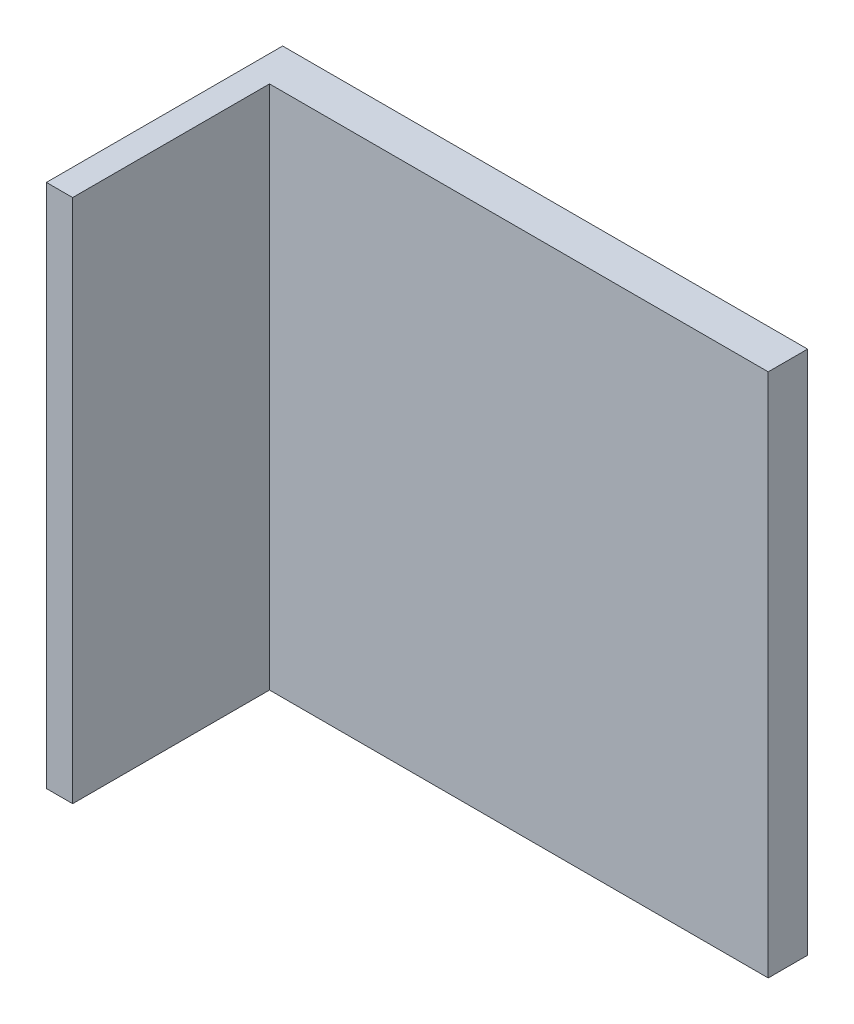
ISO-10303-21;
HEADER;
FILE_DESCRIPTION(('STEP AP214'),'2;1');
FILE_NAME('part.step','',(''),(''),'','','');
FILE_SCHEMA(('AUTOMOTIVE_DESIGN { 1 0 10303 214 1 1 1 1 }'));
ENDSEC;
DATA;
#1=APPLICATION_CONTEXT('core data for automotive mechanical design processes');
#2=APPLICATION_PROTOCOL_DEFINITION('international standard','automotive_design',2000,#1);
#3=PRODUCT_CONTEXT('',#1,'mechanical');
#4=PRODUCT('Part','Part','',(#3));
#5=PRODUCT_RELATED_PRODUCT_CATEGORY('part','',(#4));
#6=PRODUCT_DEFINITION_FORMATION('','',#4);
#7=PRODUCT_DEFINITION_CONTEXT('part definition',#1,'design');
#8=PRODUCT_DEFINITION('design','',#6,#7);
#9=PRODUCT_DEFINITION_SHAPE('','',#8);
#10=(LENGTH_UNIT() NAMED_UNIT(*) SI_UNIT(.MILLI.,.METRE.));
#11=(NAMED_UNIT(*) PLANE_ANGLE_UNIT() SI_UNIT($,.RADIAN.));
#12=(NAMED_UNIT(*) SI_UNIT($,.STERADIAN.) SOLID_ANGLE_UNIT());
#13=UNCERTAINTY_MEASURE_WITH_UNIT(LENGTH_MEASURE(1.E-05),#10,'distance_accuracy_value','');
#14=(GEOMETRIC_REPRESENTATION_CONTEXT(3) GLOBAL_UNCERTAINTY_ASSIGNED_CONTEXT((#13)) GLOBAL_UNIT_ASSIGNED_CONTEXT((#10,
#11,#12)) REPRESENTATION_CONTEXT('',''));
#15=CARTESIAN_POINT('',(0.,0.,0.));
#16=DIRECTION('',(0.,0.,1.));
#17=DIRECTION('',(1.,0.,0.));
#18=AXIS2_PLACEMENT_3D('',#15,#16,#17);
#19=CARTESIAN_POINT('',(-75.,150.,15.));
#20=DIRECTION('',(1.,0.,0.));
#21=DIRECTION('',(0.,1.,0.));
#22=AXIS2_PLACEMENT_3D('',#19,#20,#21);
#23=PLANE('',#22);
#24=DIRECTION('',(0.,-1.,0.));
#25=VECTOR('',#24,1.);
#26=CARTESIAN_POINT('',(-75.,150.,0.));
#27=LINE('',#26,#25);
#28=CARTESIAN_POINT('',(-75.,150.,0.));
#29=VERTEX_POINT('',#28);
#30=CARTESIAN_POINT('',(-75.,-50.,0.));
#31=VERTEX_POINT('',#30);
#32=EDGE_CURVE('E91',#29,#31,#27,.T.);
#33=ORIENTED_EDGE('',*,*,#32,.T.);
#34=DIRECTION('',(0.,0.,-1.));
#35=VECTOR('',#34,1.);
#36=CARTESIAN_POINT('',(-75.,-50.,15.));
#37=LINE('',#36,#35);
#38=CARTESIAN_POINT('',(-75.,-50.,90.));
#39=VERTEX_POINT('',#38);
#40=EDGE_CURVE('E11',#39,#31,#37,.T.);
#41=ORIENTED_EDGE('',*,*,#40,.F.);
#42=DIRECTION('',(0.,-1.,0.));
#43=VECTOR('',#42,1.);
#44=CARTESIAN_POINT('',(-75.,150.,90.));
#45=LINE('',#44,#43);
#46=CARTESIAN_POINT('',(-75.,150.,90.));
#47=VERTEX_POINT('',#46);
#48=EDGE_CURVE('E93',#47,#39,#45,.T.);
#49=ORIENTED_EDGE('',*,*,#48,.F.);
#50=DIRECTION('',(0.,0.,-1.));
#51=VECTOR('',#50,1.);
#52=CARTESIAN_POINT('',(-75.,150.,15.));
#53=LINE('',#52,#51);
#54=EDGE_CURVE('E77',#47,#29,#53,.T.);
#55=ORIENTED_EDGE('',*,*,#54,.T.);
#56=EDGE_LOOP('',(#33,#41,#49,#55));
#57=FACE_BOUND('',#56,.T.);
#58=ADVANCED_FACE('F33',(#57),#23,.F.);
#59=CARTESIAN_POINT('',(-75.,-50.,15.));
#60=DIRECTION('',(0.,1.,0.));
#61=DIRECTION('',(0.,0.,1.));
#62=AXIS2_PLACEMENT_3D('',#59,#60,#61);
#63=PLANE('',#62);
#64=DIRECTION('',(1.,0.,0.));
#65=VECTOR('',#64,1.);
#66=CARTESIAN_POINT('',(-75.,-50.,0.));
#67=LINE('',#66,#65);
#68=CARTESIAN_POINT('',(125.,-50.,0.));
#69=VERTEX_POINT('',#68);
#70=EDGE_CURVE('E97',#31,#69,#67,.T.);
#71=ORIENTED_EDGE('',*,*,#70,.T.);
#72=DIRECTION('',(0.,0.,-1.));
#73=VECTOR('',#72,1.);
#74=CARTESIAN_POINT('',(125.,-50.,15.));
#75=LINE('',#74,#73);
#76=CARTESIAN_POINT('',(125.,-50.,15.));
#77=VERTEX_POINT('',#76);
#78=EDGE_CURVE('E40',#77,#69,#75,.T.);
#79=ORIENTED_EDGE('',*,*,#78,.F.);
#80=DIRECTION('',(1.,0.,0.));
#81=VECTOR('',#80,1.);
#82=CARTESIAN_POINT('',(-75.,-50.,15.));
#83=LINE('',#82,#81);
#84=CARTESIAN_POINT('',(-65.,-50.,15.));
#85=VERTEX_POINT('',#84);
#86=EDGE_CURVE('E84',#85,#77,#83,.T.);
#87=ORIENTED_EDGE('',*,*,#86,.F.);
#88=DIRECTION('',(0.,0.,-1.));
#89=VECTOR('',#88,1.);
#90=CARTESIAN_POINT('',(-65.,-50.,90.));
#91=LINE('',#90,#89);
#92=CARTESIAN_POINT('',(-65.,-50.,90.));
#93=VERTEX_POINT('',#92);
#94=EDGE_CURVE('E98',#93,#85,#91,.T.);
#95=ORIENTED_EDGE('',*,*,#94,.F.);
#96=DIRECTION('',(1.,0.,0.));
#97=VECTOR('',#96,1.);
#98=CARTESIAN_POINT('',(-75.,-50.,90.));
#99=LINE('',#98,#97);
#100=EDGE_CURVE('E118',#39,#93,#99,.T.);
#101=ORIENTED_EDGE('',*,*,#100,.F.);
#102=ORIENTED_EDGE('',*,*,#40,.T.);
#103=EDGE_LOOP('',(#71,#79,#87,#95,#101,#102));
#104=FACE_BOUND('',#103,.T.);
#105=ADVANCED_FACE('F113',(#104),#63,.F.);
#106=CARTESIAN_POINT('',(125.,150.,15.));
#107=DIRECTION('',(-1.,0.,0.));
#108=DIRECTION('',(0.,0.,1.));
#109=AXIS2_PLACEMENT_3D('',#106,#107,#108);
#110=PLANE('',#109);
#111=DIRECTION('',(0.,1.,0.));
#112=VECTOR('',#111,1.);
#113=CARTESIAN_POINT('',(125.,150.,0.));
#114=LINE('',#113,#112);
#115=CARTESIAN_POINT('',(125.,150.,0.));
#116=VERTEX_POINT('',#115);
#117=EDGE_CURVE('E85',#69,#116,#114,.T.);
#118=ORIENTED_EDGE('',*,*,#117,.T.);
#119=DIRECTION('',(0.,0.,-1.));
#120=VECTOR('',#119,1.);
#121=CARTESIAN_POINT('',(125.,150.,15.));
#122=LINE('',#121,#120);
#123=CARTESIAN_POINT('',(125.,150.,15.));
#124=VERTEX_POINT('',#123);
#125=EDGE_CURVE('E80',#124,#116,#122,.T.);
#126=ORIENTED_EDGE('',*,*,#125,.F.);
#127=DIRECTION('',(0.,1.,0.));
#128=VECTOR('',#127,1.);
#129=CARTESIAN_POINT('',(125.,150.,15.));
#130=LINE('',#129,#128);
#131=EDGE_CURVE('E53',#77,#124,#130,.T.);
#132=ORIENTED_EDGE('',*,*,#131,.F.);
#133=ORIENTED_EDGE('',*,*,#78,.T.);
#134=EDGE_LOOP('',(#118,#126,#132,#133));
#135=FACE_BOUND('',#134,.T.);
#136=ADVANCED_FACE('F111',(#135),#110,.F.);
#137=CARTESIAN_POINT('',(-75.,150.,15.));
#138=DIRECTION('',(0.,-1.,0.));
#139=DIRECTION('',(0.,0.,-1.));
#140=AXIS2_PLACEMENT_3D('',#137,#138,#139);
#141=PLANE('',#140);
#142=DIRECTION('',(-1.,0.,0.));
#143=VECTOR('',#142,1.);
#144=CARTESIAN_POINT('',(-75.,150.,0.));
#145=LINE('',#144,#143);
#146=EDGE_CURVE('E73',#116,#29,#145,.T.);
#147=ORIENTED_EDGE('',*,*,#146,.T.);
#148=ORIENTED_EDGE('',*,*,#54,.F.);
#149=DIRECTION('',(-1.,0.,0.));
#150=VECTOR('',#149,1.);
#151=CARTESIAN_POINT('',(-75.,150.,90.));
#152=LINE('',#151,#150);
#153=CARTESIAN_POINT('',(-65.,150.,90.));
#154=VERTEX_POINT('',#153);
#155=EDGE_CURVE('E132',#154,#47,#152,.T.);
#156=ORIENTED_EDGE('',*,*,#155,.F.);
#157=DIRECTION('',(0.,0.,-1.));
#158=VECTOR('',#157,1.);
#159=CARTESIAN_POINT('',(-65.,150.,90.));
#160=LINE('',#159,#158);
#161=CARTESIAN_POINT('',(-65.,150.,15.));
#162=VERTEX_POINT('',#161);
#163=EDGE_CURVE('E102',#154,#162,#160,.T.);
#164=ORIENTED_EDGE('',*,*,#163,.T.);
#165=DIRECTION('',(-1.,0.,0.));
#166=VECTOR('',#165,1.);
#167=CARTESIAN_POINT('',(-75.,150.,15.));
#168=LINE('',#167,#166);
#169=EDGE_CURVE('E94',#124,#162,#168,.T.);
#170=ORIENTED_EDGE('',*,*,#169,.F.);
#171=ORIENTED_EDGE('',*,*,#125,.T.);
#172=EDGE_LOOP('',(#147,#148,#156,#164,#170,#171));
#173=FACE_BOUND('',#172,.T.);
#174=ADVANCED_FACE('F75',(#173),#141,.F.);
#175=CARTESIAN_POINT('',(0.,0.,15.));
#176=DIRECTION('',(0.,0.,1.));
#177=DIRECTION('',(1.,0.,0.));
#178=AXIS2_PLACEMENT_3D('',#175,#176,#177);
#179=PLANE('',#178);
#180=DIRECTION('',(0.,1.,0.));
#181=VECTOR('',#180,1.);
#182=CARTESIAN_POINT('',(-65.,150.,15.));
#183=LINE('',#182,#181);
#184=EDGE_CURVE('E47',#85,#162,#183,.T.);
#185=ORIENTED_EDGE('',*,*,#184,.F.);
#186=ORIENTED_EDGE('',*,*,#86,.T.);
#187=ORIENTED_EDGE('',*,*,#131,.T.);
#188=ORIENTED_EDGE('',*,*,#169,.T.);
#189=EDGE_LOOP('',(#185,#186,#187,#188));
#190=FACE_BOUND('',#189,.T.);
#191=ADVANCED_FACE('F142',(#190),#179,.T.);
#192=CARTESIAN_POINT('',(0.,0.,0.));
#193=DIRECTION('',(0.,0.,1.));
#194=DIRECTION('',(1.,0.,0.));
#195=AXIS2_PLACEMENT_3D('',#192,#193,#194);
#196=PLANE('',#195);
#197=ORIENTED_EDGE('',*,*,#32,.F.);
#198=ORIENTED_EDGE('',*,*,#146,.F.);
#199=ORIENTED_EDGE('',*,*,#117,.F.);
#200=ORIENTED_EDGE('',*,*,#70,.F.);
#201=EDGE_LOOP('',(#197,#198,#199,#200));
#202=FACE_BOUND('',#201,.T.);
#203=ADVANCED_FACE('F96',(#202),#196,.F.);
#204=CARTESIAN_POINT('',(-65.,150.,90.));
#205=DIRECTION('',(-1.,0.,0.));
#206=DIRECTION('',(0.,-1.,0.));
#207=AXIS2_PLACEMENT_3D('',#204,#205,#206);
#208=PLANE('',#207);
#209=ORIENTED_EDGE('',*,*,#184,.T.);
#210=ORIENTED_EDGE('',*,*,#163,.F.);
#211=DIRECTION('',(0.,1.,0.));
#212=VECTOR('',#211,1.);
#213=CARTESIAN_POINT('',(-65.,150.,90.));
#214=LINE('',#213,#212);
#215=EDGE_CURVE('E129',#93,#154,#214,.T.);
#216=ORIENTED_EDGE('',*,*,#215,.F.);
#217=ORIENTED_EDGE('',*,*,#94,.T.);
#218=EDGE_LOOP('',(#209,#210,#216,#217));
#219=FACE_BOUND('',#218,.T.);
#220=ADVANCED_FACE('F136',(#219),#208,.F.);
#221=CARTESIAN_POINT('',(0.,0.,90.));
#222=DIRECTION('',(0.,0.,1.));
#223=DIRECTION('',(1.,0.,0.));
#224=AXIS2_PLACEMENT_3D('',#221,#222,#223);
#225=PLANE('',#224);
#226=ORIENTED_EDGE('',*,*,#48,.T.);
#227=ORIENTED_EDGE('',*,*,#100,.T.);
#228=ORIENTED_EDGE('',*,*,#215,.T.);
#229=ORIENTED_EDGE('',*,*,#155,.T.);
#230=EDGE_LOOP('',(#226,#227,#228,#229));
#231=FACE_BOUND('',#230,.T.);
#232=ADVANCED_FACE('F131',(#231),#225,.T.);
#233=CLOSED_SHELL('',(#58,#105,#136,#174,#191,#203,#220,#232));
#234=MANIFOLD_SOLID_BREP('B2',#233);
#235=ADVANCED_BREP_SHAPE_REPRESENTATION('',(#18,#234),#14);
#236=SHAPE_DEFINITION_REPRESENTATION(#9,#235);
ENDSEC;
END-ISO-10303-21;
